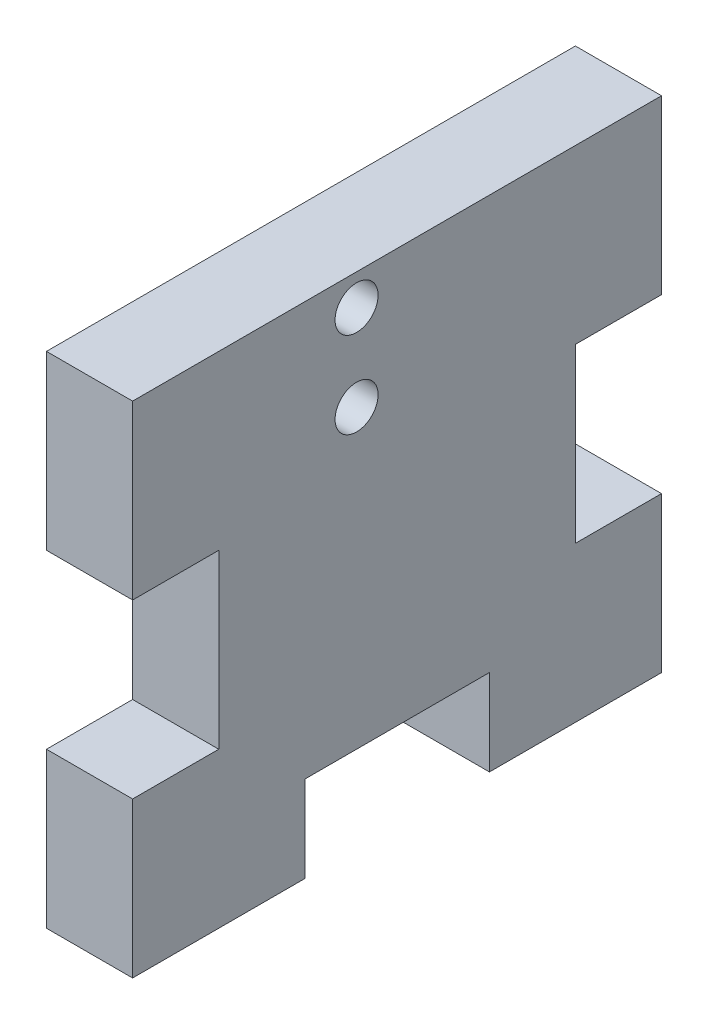
ISO-10303-21;
HEADER;
FILE_DESCRIPTION(('STEP AP214'),'2;1');
FILE_NAME('part.step','',(''),(''),'','','');
FILE_SCHEMA(('AUTOMOTIVE_DESIGN { 1 0 10303 214 1 1 1 1 }'));
ENDSEC;
DATA;
#1=APPLICATION_CONTEXT('core data for automotive mechanical design processes');
#2=APPLICATION_PROTOCOL_DEFINITION('international standard','automotive_design',2000,#1);
#3=PRODUCT_CONTEXT('',#1,'mechanical');
#4=PRODUCT('Part','Part','',(#3));
#5=PRODUCT_RELATED_PRODUCT_CATEGORY('part','',(#4));
#6=PRODUCT_DEFINITION_FORMATION('','',#4);
#7=PRODUCT_DEFINITION_CONTEXT('part definition',#1,'design');
#8=PRODUCT_DEFINITION('design','',#6,#7);
#9=PRODUCT_DEFINITION_SHAPE('','',#8);
#10=(LENGTH_UNIT() NAMED_UNIT(*) SI_UNIT(.MILLI.,.METRE.));
#11=(NAMED_UNIT(*) PLANE_ANGLE_UNIT() SI_UNIT($,.RADIAN.));
#12=(NAMED_UNIT(*) SI_UNIT($,.STERADIAN.) SOLID_ANGLE_UNIT());
#13=UNCERTAINTY_MEASURE_WITH_UNIT(LENGTH_MEASURE(1.E-05),#10,'distance_accuracy_value','');
#14=(GEOMETRIC_REPRESENTATION_CONTEXT(3) GLOBAL_UNCERTAINTY_ASSIGNED_CONTEXT((#13)) GLOBAL_UNIT_ASSIGNED_CONTEXT((#10,
#11,#12)) REPRESENTATION_CONTEXT('',''));
#15=CARTESIAN_POINT('',(0.,0.,0.));
#16=DIRECTION('',(0.,0.,1.));
#17=DIRECTION('',(1.,0.,0.));
#18=AXIS2_PLACEMENT_3D('',#15,#16,#17);
#19=CARTESIAN_POINT('',(72.39,17.78,0.));
#20=DIRECTION('',(0.,-1.,0.));
#21=DIRECTION('',(0.,0.,-1.));
#22=AXIS2_PLACEMENT_3D('',#19,#20,#21);
#23=PLANE('',#22);
#24=DIRECTION('',(0.,0.,-1.));
#25=VECTOR('',#24,1.);
#26=CARTESIAN_POINT('',(78.74,17.78,0.));
#27=LINE('',#26,#25);
#28=CARTESIAN_POINT('',(78.74,17.78,6.33525113809477));
#29=VERTEX_POINT('',#28);
#30=CARTESIAN_POINT('',(78.74,17.78,-0.0147488619052227));
#31=VERTEX_POINT('',#30);
#32=EDGE_CURVE('E261',#29,#31,#27,.T.);
#33=ORIENTED_EDGE('',*,*,#32,.F.);
#34=DIRECTION('',(1.,0.,0.));
#35=VECTOR('',#34,1.);
#36=CARTESIAN_POINT('',(72.39,17.78,6.33525113809477));
#37=LINE('',#36,#35);
#38=CARTESIAN_POINT('',(72.39,17.78,6.33525113809477));
#39=VERTEX_POINT('',#38);
#40=EDGE_CURVE('E11',#39,#29,#37,.T.);
#41=ORIENTED_EDGE('',*,*,#40,.F.);
#42=DIRECTION('',(0.,0.,-1.));
#43=VECTOR('',#42,1.);
#44=CARTESIAN_POINT('',(72.39,17.78,0.));
#45=LINE('',#44,#43);
#46=CARTESIAN_POINT('',(72.39,17.78,-0.0147488619052227));
#47=VERTEX_POINT('',#46);
#48=EDGE_CURVE('E208',#39,#47,#45,.T.);
#49=ORIENTED_EDGE('',*,*,#48,.T.);
#50=DIRECTION('',(1.,0.,0.));
#51=VECTOR('',#50,1.);
#52=CARTESIAN_POINT('',(72.39,17.78,-0.0147488619052227));
#53=LINE('',#52,#51);
#54=EDGE_CURVE('E36',#47,#31,#53,.T.);
#55=ORIENTED_EDGE('',*,*,#54,.T.);
#56=EDGE_LOOP('',(#33,#41,#49,#55));
#57=FACE_BOUND('',#56,.T.);
#58=ADVANCED_FACE('F32',(#57),#23,.T.);
#59=CARTESIAN_POINT('',(72.39,0.,6.33525113809477));
#60=DIRECTION('',(0.,0.,-1.));
#61=DIRECTION('',(-1.,0.,0.));
#62=AXIS2_PLACEMENT_3D('',#59,#60,#61);
#63=PLANE('',#62);
#64=DIRECTION('',(0.,1.,0.));
#65=VECTOR('',#64,1.);
#66=CARTESIAN_POINT('',(78.74,0.,6.33525113809477));
#67=LINE('',#66,#65);
#68=CARTESIAN_POINT('',(78.74,30.48,6.33525113809477));
#69=VERTEX_POINT('',#68);
#70=EDGE_CURVE('E216',#29,#69,#67,.T.);
#71=ORIENTED_EDGE('',*,*,#70,.T.);
#72=DIRECTION('',(1.,0.,0.));
#73=VECTOR('',#72,1.);
#74=CARTESIAN_POINT('',(72.39,30.48,6.33525113809477));
#75=LINE('',#74,#73);
#76=CARTESIAN_POINT('',(72.39,30.48,6.33525113809477));
#77=VERTEX_POINT('',#76);
#78=EDGE_CURVE('E42',#77,#69,#75,.T.);
#79=ORIENTED_EDGE('',*,*,#78,.F.);
#80=DIRECTION('',(0.,1.,0.));
#81=VECTOR('',#80,1.);
#82=CARTESIAN_POINT('',(72.39,0.,6.33525113809477));
#83=LINE('',#82,#81);
#84=EDGE_CURVE('E169',#39,#77,#83,.T.);
#85=ORIENTED_EDGE('',*,*,#84,.F.);
#86=ORIENTED_EDGE('',*,*,#40,.T.);
#87=EDGE_LOOP('',(#71,#79,#85,#86));
#88=FACE_BOUND('',#87,.T.);
#89=ADVANCED_FACE('F302',(#88),#63,.F.);
#90=CARTESIAN_POINT('',(72.39,30.48,0.));
#91=DIRECTION('',(0.,1.,0.));
#92=DIRECTION('',(0.,0.,1.));
#93=AXIS2_PLACEMENT_3D('',#90,#91,#92);
#94=PLANE('',#93);
#95=DIRECTION('',(0.,0.,1.));
#96=VECTOR('',#95,1.);
#97=CARTESIAN_POINT('',(78.74,30.48,0.));
#98=LINE('',#97,#96);
#99=CARTESIAN_POINT('',(78.74,30.48,-32.6554205404025));
#100=VERTEX_POINT('',#99);
#101=EDGE_CURVE('E155',#100,#69,#98,.T.);
#102=ORIENTED_EDGE('',*,*,#101,.F.);
#103=DIRECTION('',(1.,0.,0.));
#104=VECTOR('',#103,1.);
#105=CARTESIAN_POINT('',(72.39,30.48,-32.6554205404025));
#106=LINE('',#105,#104);
#107=CARTESIAN_POINT('',(72.39,30.48,-32.6554205404025));
#108=VERTEX_POINT('',#107);
#109=EDGE_CURVE('E150',#108,#100,#106,.T.);
#110=ORIENTED_EDGE('',*,*,#109,.F.);
#111=DIRECTION('',(0.,0.,1.));
#112=VECTOR('',#111,1.);
#113=CARTESIAN_POINT('',(72.39,30.48,0.));
#114=LINE('',#113,#112);
#115=EDGE_CURVE('E153',#108,#77,#114,.T.);
#116=ORIENTED_EDGE('',*,*,#115,.T.);
#117=ORIENTED_EDGE('',*,*,#78,.T.);
#118=EDGE_LOOP('',(#102,#110,#116,#117));
#119=FACE_BOUND('',#118,.T.);
#120=ADVANCED_FACE('F152',(#119),#94,.T.);
#121=CARTESIAN_POINT('',(72.39,0.,-32.6554205404025));
#122=DIRECTION('',(0.,0.,-1.));
#123=DIRECTION('',(-1.,0.,0.));
#124=AXIS2_PLACEMENT_3D('',#121,#122,#123);
#125=PLANE('',#124);
#126=DIRECTION('',(0.,1.,0.));
#127=VECTOR('',#126,1.);
#128=CARTESIAN_POINT('',(78.74,0.,-32.6554205404025));
#129=LINE('',#128,#127);
#130=CARTESIAN_POINT('',(78.74,17.78,-32.6554205404025));
#131=VERTEX_POINT('',#130);
#132=EDGE_CURVE('E289',#131,#100,#129,.T.);
#133=ORIENTED_EDGE('',*,*,#132,.F.);
#134=DIRECTION('',(1.,0.,0.));
#135=VECTOR('',#134,1.);
#136=CARTESIAN_POINT('',(72.39,17.78,-32.6554205404025));
#137=LINE('',#136,#135);
#138=CARTESIAN_POINT('',(72.39,17.78,-32.6554205404025));
#139=VERTEX_POINT('',#138);
#140=EDGE_CURVE('E160',#139,#131,#137,.T.);
#141=ORIENTED_EDGE('',*,*,#140,.F.);
#142=DIRECTION('',(0.,1.,0.));
#143=VECTOR('',#142,1.);
#144=CARTESIAN_POINT('',(72.39,0.,-32.6554205404025));
#145=LINE('',#144,#143);
#146=EDGE_CURVE('E168',#139,#108,#145,.T.);
#147=ORIENTED_EDGE('',*,*,#146,.T.);
#148=ORIENTED_EDGE('',*,*,#109,.T.);
#149=EDGE_LOOP('',(#133,#141,#147,#148));
#150=FACE_BOUND('',#149,.T.);
#151=ADVANCED_FACE('F171',(#150),#125,.T.);
#152=CARTESIAN_POINT('',(72.39,17.78,0.));
#153=DIRECTION('',(0.,1.,0.));
#154=DIRECTION('',(0.,0.,1.));
#155=AXIS2_PLACEMENT_3D('',#152,#153,#154);
#156=PLANE('',#155);
#157=DIRECTION('',(0.,0.,1.));
#158=VECTOR('',#157,1.);
#159=CARTESIAN_POINT('',(78.74,17.78,0.));
#160=LINE('',#159,#158);
#161=CARTESIAN_POINT('',(78.74,17.78,-26.3201694023077));
#162=VERTEX_POINT('',#161);
#163=EDGE_CURVE('E294',#131,#162,#160,.T.);
#164=ORIENTED_EDGE('',*,*,#163,.T.);
#165=DIRECTION('',(1.,0.,0.));
#166=VECTOR('',#165,1.);
#167=CARTESIAN_POINT('',(72.39,17.78,-26.3201694023077));
#168=LINE('',#167,#166);
#169=CARTESIAN_POINT('',(72.39,17.78,-26.3201694023077));
#170=VERTEX_POINT('',#169);
#171=EDGE_CURVE('E227',#170,#162,#168,.T.);
#172=ORIENTED_EDGE('',*,*,#171,.F.);
#173=DIRECTION('',(0.,0.,1.));
#174=VECTOR('',#173,1.);
#175=CARTESIAN_POINT('',(72.39,17.78,0.));
#176=LINE('',#175,#174);
#177=EDGE_CURVE('E173',#139,#170,#176,.T.);
#178=ORIENTED_EDGE('',*,*,#177,.F.);
#179=ORIENTED_EDGE('',*,*,#140,.T.);
#180=EDGE_LOOP('',(#164,#172,#178,#179));
#181=FACE_BOUND('',#180,.T.);
#182=ADVANCED_FACE('F343',(#181),#156,.F.);
#183=CARTESIAN_POINT('',(72.39,0.,-26.3201694023077));
#184=DIRECTION('',(0.,0.,1.));
#185=DIRECTION('',(0.,-1.,0.));
#186=AXIS2_PLACEMENT_3D('',#183,#184,#185);
#187=PLANE('',#186);
#188=DIRECTION('',(0.,-1.,0.));
#189=VECTOR('',#188,1.);
#190=CARTESIAN_POINT('',(78.74,0.,-26.3201694023077));
#191=LINE('',#190,#189);
#192=CARTESIAN_POINT('',(78.74,5.08,-26.3201694023077));
#193=VERTEX_POINT('',#192);
#194=EDGE_CURVE('E292',#162,#193,#191,.T.);
#195=ORIENTED_EDGE('',*,*,#194,.T.);
#196=DIRECTION('',(1.,0.,0.));
#197=VECTOR('',#196,1.);
#198=CARTESIAN_POINT('',(72.39,5.08,-26.3201694023077));
#199=LINE('',#198,#197);
#200=CARTESIAN_POINT('',(72.39,5.08,-26.3201694023077));
#201=VERTEX_POINT('',#200);
#202=EDGE_CURVE('E230',#201,#193,#199,.T.);
#203=ORIENTED_EDGE('',*,*,#202,.F.);
#204=DIRECTION('',(0.,-1.,0.));
#205=VECTOR('',#204,1.);
#206=CARTESIAN_POINT('',(72.39,0.,-26.3201694023077));
#207=LINE('',#206,#205);
#208=EDGE_CURVE('E176',#170,#201,#207,.T.);
#209=ORIENTED_EDGE('',*,*,#208,.F.);
#210=ORIENTED_EDGE('',*,*,#171,.T.);
#211=EDGE_LOOP('',(#195,#203,#209,#210));
#212=FACE_BOUND('',#211,.T.);
#213=ADVANCED_FACE('F339',(#212),#187,.F.);
#214=CARTESIAN_POINT('',(72.39,5.08,0.));
#215=DIRECTION('',(0.,1.,0.));
#216=DIRECTION('',(0.,0.,1.));
#217=AXIS2_PLACEMENT_3D('',#214,#215,#216);
#218=PLANE('',#217);
#219=DIRECTION('',(0.,0.,1.));
#220=VECTOR('',#219,1.);
#221=CARTESIAN_POINT('',(78.74,5.08,0.));
#222=LINE('',#221,#220);
#223=CARTESIAN_POINT('',(78.74,5.08,-32.6554205404025));
#224=VERTEX_POINT('',#223);
#225=EDGE_CURVE('E288',#224,#193,#222,.T.);
#226=ORIENTED_EDGE('',*,*,#225,.F.);
#227=DIRECTION('',(1.,0.,0.));
#228=VECTOR('',#227,1.);
#229=CARTESIAN_POINT('',(72.39,5.08,-32.6554205404025));
#230=LINE('',#229,#228);
#231=CARTESIAN_POINT('',(72.39,5.08,-32.6554205404025));
#232=VERTEX_POINT('',#231);
#233=EDGE_CURVE('E232',#232,#224,#230,.T.);
#234=ORIENTED_EDGE('',*,*,#233,.F.);
#235=DIRECTION('',(0.,0.,1.));
#236=VECTOR('',#235,1.);
#237=CARTESIAN_POINT('',(72.39,5.08,0.));
#238=LINE('',#237,#236);
#239=EDGE_CURVE('E181',#232,#201,#238,.T.);
#240=ORIENTED_EDGE('',*,*,#239,.T.);
#241=ORIENTED_EDGE('',*,*,#202,.T.);
#242=EDGE_LOOP('',(#226,#234,#240,#241));
#243=FACE_BOUND('',#242,.T.);
#244=ADVANCED_FACE('F336',(#243),#218,.T.);
#245=CARTESIAN_POINT('',(78.74,-6.34999999999999,-32.6554205404025));
#246=VERTEX_POINT('',#245);
#247=EDGE_CURVE('E285',#246,#224,#129,.T.);
#248=ORIENTED_EDGE('',*,*,#247,.F.);
#249=DIRECTION('',(1.,0.,0.));
#250=VECTOR('',#249,1.);
#251=CARTESIAN_POINT('',(72.39,-6.34999999999999,-32.6554205404025));
#252=LINE('',#251,#250);
#253=CARTESIAN_POINT('',(72.39,-6.34999999999999,-32.6554205404025));
#254=VERTEX_POINT('',#253);
#255=EDGE_CURVE('E234',#254,#246,#252,.T.);
#256=ORIENTED_EDGE('',*,*,#255,.F.);
#257=EDGE_CURVE('E175',#254,#232,#145,.T.);
#258=ORIENTED_EDGE('',*,*,#257,.T.);
#259=ORIENTED_EDGE('',*,*,#233,.T.);
#260=EDGE_LOOP('',(#248,#256,#258,#259));
#261=FACE_BOUND('',#260,.T.);
#262=ADVANCED_FACE('F335',(#261),#125,.T.);
#263=CARTESIAN_POINT('',(72.39,-6.35,0.));
#264=DIRECTION('',(0.,-1.,0.));
#265=DIRECTION('',(0.,0.,-1.));
#266=AXIS2_PLACEMENT_3D('',#263,#264,#265);
#267=PLANE('',#266);
#268=DIRECTION('',(0.,0.,-1.));
#269=VECTOR('',#268,1.);
#270=CARTESIAN_POINT('',(78.74,-6.35,0.));
#271=LINE('',#270,#269);
#272=CARTESIAN_POINT('',(78.74,-6.35,-19.9701694023077));
#273=VERTEX_POINT('',#272);
#274=EDGE_CURVE('E282',#273,#246,#271,.T.);
#275=ORIENTED_EDGE('',*,*,#274,.F.);
#276=DIRECTION('',(1.,0.,0.));
#277=VECTOR('',#276,1.);
#278=CARTESIAN_POINT('',(72.39,-6.35,-19.9701694023077));
#279=LINE('',#278,#277);
#280=CARTESIAN_POINT('',(72.39,-6.35,-19.9701694023077));
#281=VERTEX_POINT('',#280);
#282=EDGE_CURVE('E236',#281,#273,#279,.T.);
#283=ORIENTED_EDGE('',*,*,#282,.F.);
#284=DIRECTION('',(0.,0.,-1.));
#285=VECTOR('',#284,1.);
#286=CARTESIAN_POINT('',(72.39,-6.35,0.));
#287=LINE('',#286,#285);
#288=EDGE_CURVE('E182',#281,#254,#287,.T.);
#289=ORIENTED_EDGE('',*,*,#288,.T.);
#290=ORIENTED_EDGE('',*,*,#255,.T.);
#291=EDGE_LOOP('',(#275,#283,#289,#290));
#292=FACE_BOUND('',#291,.T.);
#293=ADVANCED_FACE('F331',(#292),#267,.T.);
#294=CARTESIAN_POINT('',(72.39,0.,-19.9701694023077));
#295=DIRECTION('',(0.,0.,1.));
#296=DIRECTION('',(1.,0.,0.));
#297=AXIS2_PLACEMENT_3D('',#294,#295,#296);
#298=PLANE('',#297);
#299=DIRECTION('',(0.,-1.,0.));
#300=VECTOR('',#299,1.);
#301=CARTESIAN_POINT('',(78.74,0.,-19.9701694023077));
#302=LINE('',#301,#300);
#303=CARTESIAN_POINT('',(78.74,0.,-19.9701694023077));
#304=VERTEX_POINT('',#303);
#305=EDGE_CURVE('E279',#304,#273,#302,.T.);
#306=ORIENTED_EDGE('',*,*,#305,.F.);
#307=DIRECTION('',(1.,0.,0.));
#308=VECTOR('',#307,1.);
#309=CARTESIAN_POINT('',(72.39,0.,-19.9701694023077));
#310=LINE('',#309,#308);
#311=CARTESIAN_POINT('',(72.39,0.,-19.9701694023077));
#312=VERTEX_POINT('',#311);
#313=EDGE_CURVE('E238',#312,#304,#310,.T.);
#314=ORIENTED_EDGE('',*,*,#313,.F.);
#315=DIRECTION('',(0.,-1.,0.));
#316=VECTOR('',#315,1.);
#317=CARTESIAN_POINT('',(72.39,0.,-19.9701694023077));
#318=LINE('',#317,#316);
#319=EDGE_CURVE('E187',#312,#281,#318,.T.);
#320=ORIENTED_EDGE('',*,*,#319,.T.);
#321=ORIENTED_EDGE('',*,*,#282,.T.);
#322=EDGE_LOOP('',(#306,#314,#320,#321));
#323=FACE_BOUND('',#322,.T.);
#324=ADVANCED_FACE('F327',(#323),#298,.T.);
#325=CARTESIAN_POINT('',(72.39,0.,0.));
#326=DIRECTION('',(0.,1.,0.));
#327=DIRECTION('',(0.,0.,1.));
#328=AXIS2_PLACEMENT_3D('',#325,#326,#327);
#329=PLANE('',#328);
#330=DIRECTION('',(0.,0.,1.));
#331=VECTOR('',#330,1.);
#332=CARTESIAN_POINT('',(78.74,0.,0.));
#333=LINE('',#332,#331);
#334=CARTESIAN_POINT('',(78.74,0.,-6.36474886190522));
#335=VERTEX_POINT('',#334);
#336=EDGE_CURVE('E276',#304,#335,#333,.T.);
#337=ORIENTED_EDGE('',*,*,#336,.T.);
#338=DIRECTION('',(1.,0.,0.));
#339=VECTOR('',#338,1.);
#340=CARTESIAN_POINT('',(72.39,0.,-6.36474886190522));
#341=LINE('',#340,#339);
#342=CARTESIAN_POINT('',(72.39,0.,-6.36474886190522));
#343=VERTEX_POINT('',#342);
#344=EDGE_CURVE('E240',#343,#335,#341,.T.);
#345=ORIENTED_EDGE('',*,*,#344,.F.);
#346=DIRECTION('',(0.,0.,1.));
#347=VECTOR('',#346,1.);
#348=CARTESIAN_POINT('',(72.39,0.,0.));
#349=LINE('',#348,#347);
#350=EDGE_CURVE('E191',#312,#343,#349,.T.);
#351=ORIENTED_EDGE('',*,*,#350,.F.);
#352=ORIENTED_EDGE('',*,*,#313,.T.);
#353=EDGE_LOOP('',(#337,#345,#351,#352));
#354=FACE_BOUND('',#353,.T.);
#355=ADVANCED_FACE('F323',(#354),#329,.F.);
#356=CARTESIAN_POINT('',(72.39,0.,-6.36474886190522));
#357=DIRECTION('',(0.,0.,1.));
#358=DIRECTION('',(1.,0.,0.));
#359=AXIS2_PLACEMENT_3D('',#356,#357,#358);
#360=PLANE('',#359);
#361=DIRECTION('',(0.,-1.,0.));
#362=VECTOR('',#361,1.);
#363=CARTESIAN_POINT('',(78.74,0.,-6.36474886190522));
#364=LINE('',#363,#362);
#365=CARTESIAN_POINT('',(78.74,-6.35,-6.36474886190522));
#366=VERTEX_POINT('',#365);
#367=EDGE_CURVE('E273',#335,#366,#364,.T.);
#368=ORIENTED_EDGE('',*,*,#367,.T.);
#369=DIRECTION('',(1.,0.,0.));
#370=VECTOR('',#369,1.);
#371=CARTESIAN_POINT('',(72.39,-6.35,-6.36474886190522));
#372=LINE('',#371,#370);
#373=CARTESIAN_POINT('',(72.39,-6.35,-6.36474886190522));
#374=VERTEX_POINT('',#373);
#375=EDGE_CURVE('E243',#374,#366,#372,.T.);
#376=ORIENTED_EDGE('',*,*,#375,.F.);
#377=DIRECTION('',(0.,-1.,0.));
#378=VECTOR('',#377,1.);
#379=CARTESIAN_POINT('',(72.39,0.,-6.36474886190522));
#380=LINE('',#379,#378);
#381=EDGE_CURVE('E196',#343,#374,#380,.T.);
#382=ORIENTED_EDGE('',*,*,#381,.F.);
#383=ORIENTED_EDGE('',*,*,#344,.T.);
#384=EDGE_LOOP('',(#368,#376,#382,#383));
#385=FACE_BOUND('',#384,.T.);
#386=ADVANCED_FACE('F319',(#385),#360,.F.);
#387=CARTESIAN_POINT('',(72.39,-6.35,0.));
#388=DIRECTION('',(0.,-1.,0.));
#389=DIRECTION('',(0.,0.,-1.));
#390=AXIS2_PLACEMENT_3D('',#387,#388,#389);
#391=PLANE('',#390);
#392=DIRECTION('',(0.,0.,-1.));
#393=VECTOR('',#392,1.);
#394=CARTESIAN_POINT('',(78.74,-6.35,0.));
#395=LINE('',#394,#393);
#396=CARTESIAN_POINT('',(78.74,-6.35,6.33525113809477));
#397=VERTEX_POINT('',#396);
#398=EDGE_CURVE('E270',#397,#366,#395,.T.);
#399=ORIENTED_EDGE('',*,*,#398,.F.);
#400=DIRECTION('',(1.,0.,0.));
#401=VECTOR('',#400,1.);
#402=CARTESIAN_POINT('',(72.39,-6.35,6.33525113809477));
#403=LINE('',#402,#401);
#404=CARTESIAN_POINT('',(72.39,-6.35,6.33525113809477));
#405=VERTEX_POINT('',#404);
#406=EDGE_CURVE('E245',#405,#397,#403,.T.);
#407=ORIENTED_EDGE('',*,*,#406,.F.);
#408=DIRECTION('',(0.,0.,-1.));
#409=VECTOR('',#408,1.);
#410=CARTESIAN_POINT('',(72.39,-6.35,0.));
#411=LINE('',#410,#409);
#412=EDGE_CURVE('E198',#405,#374,#411,.T.);
#413=ORIENTED_EDGE('',*,*,#412,.T.);
#414=ORIENTED_EDGE('',*,*,#375,.T.);
#415=EDGE_LOOP('',(#399,#407,#413,#414));
#416=FACE_BOUND('',#415,.T.);
#417=ADVANCED_FACE('F316',(#416),#391,.T.);
#418=CARTESIAN_POINT('',(78.74,5.08,6.33525113809477));
#419=VERTEX_POINT('',#418);
#420=EDGE_CURVE('E221',#397,#419,#67,.T.);
#421=ORIENTED_EDGE('',*,*,#420,.T.);
#422=DIRECTION('',(1.,0.,0.));
#423=VECTOR('',#422,1.);
#424=CARTESIAN_POINT('',(72.39,5.08,6.33525113809477));
#425=LINE('',#424,#423);
#426=CARTESIAN_POINT('',(72.39,5.08,6.33525113809477));
#427=VERTEX_POINT('',#426);
#428=EDGE_CURVE('E247',#427,#419,#425,.T.);
#429=ORIENTED_EDGE('',*,*,#428,.F.);
#430=EDGE_CURVE('E201',#405,#427,#83,.T.);
#431=ORIENTED_EDGE('',*,*,#430,.F.);
#432=ORIENTED_EDGE('',*,*,#406,.T.);
#433=EDGE_LOOP('',(#421,#429,#431,#432));
#434=FACE_BOUND('',#433,.T.);
#435=ADVANCED_FACE('F307',(#434),#63,.F.);
#436=CARTESIAN_POINT('',(72.39,5.08,0.));
#437=DIRECTION('',(0.,-1.,0.));
#438=DIRECTION('',(0.,0.,-1.));
#439=AXIS2_PLACEMENT_3D('',#436,#437,#438);
#440=PLANE('',#439);
#441=DIRECTION('',(0.,0.,-1.));
#442=VECTOR('',#441,1.);
#443=CARTESIAN_POINT('',(78.74,5.08,0.));
#444=LINE('',#443,#442);
#445=CARTESIAN_POINT('',(78.74,5.08,-0.0147488619052227));
#446=VERTEX_POINT('',#445);
#447=EDGE_CURVE('E267',#419,#446,#444,.T.);
#448=ORIENTED_EDGE('',*,*,#447,.T.);
#449=DIRECTION('',(1.,0.,0.));
#450=VECTOR('',#449,1.);
#451=CARTESIAN_POINT('',(72.39,5.08,-0.0147488619052227));
#452=LINE('',#451,#450);
#453=CARTESIAN_POINT('',(72.39,5.08,-0.0147488619052227));
#454=VERTEX_POINT('',#453);
#455=EDGE_CURVE('E249',#454,#446,#452,.T.);
#456=ORIENTED_EDGE('',*,*,#455,.F.);
#457=DIRECTION('',(0.,0.,-1.));
#458=VECTOR('',#457,1.);
#459=CARTESIAN_POINT('',(72.39,5.08,0.));
#460=LINE('',#459,#458);
#461=EDGE_CURVE('E204',#427,#454,#460,.T.);
#462=ORIENTED_EDGE('',*,*,#461,.F.);
#463=ORIENTED_EDGE('',*,*,#428,.T.);
#464=EDGE_LOOP('',(#448,#456,#462,#463));
#465=FACE_BOUND('',#464,.T.);
#466=ADVANCED_FACE('F312',(#465),#440,.F.);
#467=CARTESIAN_POINT('',(72.39,0.,-0.0147488619052227));
#468=DIRECTION('',(0.,0.,1.));
#469=DIRECTION('',(1.,0.,0.));
#470=AXIS2_PLACEMENT_3D('',#467,#468,#469);
#471=PLANE('',#470);
#472=DIRECTION('',(0.,-1.,0.));
#473=VECTOR('',#472,1.);
#474=CARTESIAN_POINT('',(78.74,0.,-0.0147488619052227));
#475=LINE('',#474,#473);
#476=EDGE_CURVE('E264',#31,#446,#475,.T.);
#477=ORIENTED_EDGE('',*,*,#476,.F.);
#478=ORIENTED_EDGE('',*,*,#54,.F.);
#479=DIRECTION('',(0.,-1.,0.));
#480=VECTOR('',#479,1.);
#481=CARTESIAN_POINT('',(72.39,0.,-0.0147488619052227));
#482=LINE('',#481,#480);
#483=EDGE_CURVE('E206',#47,#454,#482,.T.);
#484=ORIENTED_EDGE('',*,*,#483,.T.);
#485=ORIENTED_EDGE('',*,*,#455,.T.);
#486=EDGE_LOOP('',(#477,#478,#484,#485));
#487=FACE_BOUND('',#486,.T.);
#488=ADVANCED_FACE('F309',(#487),#471,.T.);
#489=CARTESIAN_POINT('',(72.39,28.194,-10.1747488619052));
#490=DIRECTION('',(1.,0.,0.));
#491=DIRECTION('',(0.,0.,-1.));
#492=AXIS2_PLACEMENT_3D('',#489,#490,#491);
#493=CYLINDRICAL_SURFACE('',#492,1.5875);
#494=CARTESIAN_POINT('',(72.39,28.194,-10.1747488619052));
#495=DIRECTION('',(1.,0.,0.));
#496=DIRECTION('',(0.,0.,-1.));
#497=AXIS2_PLACEMENT_3D('',#494,#495,#496);
#498=CIRCLE('',#497,1.5875);
#499=CARTESIAN_POINT('',(72.39,28.194,-11.7622488619052));
#500=VERTEX_POINT('',#499);
#501=EDGE_CURVE('E210',#500,#500,#498,.F.);
#502=ORIENTED_EDGE('',*,*,#501,.T.);
#503=EDGE_LOOP('',(#502));
#504=FACE_BOUND('',#503,.T.);
#505=CARTESIAN_POINT('',(78.74,28.194,-10.1747488619052));
#506=DIRECTION('',(1.,0.,0.));
#507=DIRECTION('',(0.,0.,-1.));
#508=AXIS2_PLACEMENT_3D('',#505,#506,#507);
#509=CIRCLE('',#508,1.5875);
#510=CARTESIAN_POINT('',(78.74,28.194,-11.7622488619052));
#511=VERTEX_POINT('',#510);
#512=EDGE_CURVE('E258',#511,#511,#509,.F.);
#513=ORIENTED_EDGE('',*,*,#512,.F.);
#514=EDGE_LOOP('',(#513));
#515=FACE_BOUND('',#514,.T.);
#516=ADVANCED_FACE('F34',(#504,#515),#493,.F.);
#517=CARTESIAN_POINT('',(72.39,21.844,-10.1747488619052));
#518=DIRECTION('',(1.,0.,0.));
#519=DIRECTION('',(0.,0.,-1.));
#520=AXIS2_PLACEMENT_3D('',#517,#518,#519);
#521=CYLINDRICAL_SURFACE('',#520,1.5875);
#522=CARTESIAN_POINT('',(72.39,21.844,-10.1747488619052));
#523=DIRECTION('',(1.,0.,0.));
#524=DIRECTION('',(0.,0.,-1.));
#525=AXIS2_PLACEMENT_3D('',#522,#523,#524);
#526=CIRCLE('',#525,1.5875);
#527=CARTESIAN_POINT('',(72.39,21.844,-11.7622488619052));
#528=VERTEX_POINT('',#527);
#529=EDGE_CURVE('E252',#528,#528,#526,.F.);
#530=ORIENTED_EDGE('',*,*,#529,.T.);
#531=EDGE_LOOP('',(#530));
#532=FACE_BOUND('',#531,.T.);
#533=CARTESIAN_POINT('',(78.74,21.844,-10.1747488619052));
#534=DIRECTION('',(1.,0.,0.));
#535=DIRECTION('',(0.,0.,-1.));
#536=AXIS2_PLACEMENT_3D('',#533,#534,#535);
#537=CIRCLE('',#536,1.5875);
#538=CARTESIAN_POINT('',(78.74,21.844,-11.7622488619052));
#539=VERTEX_POINT('',#538);
#540=EDGE_CURVE('E212',#539,#539,#537,.F.);
#541=ORIENTED_EDGE('',*,*,#540,.F.);
#542=EDGE_LOOP('',(#541));
#543=FACE_BOUND('',#542,.T.);
#544=ADVANCED_FACE('F351',(#532,#543),#521,.F.);
#545=CARTESIAN_POINT('',(72.39,0.,0.));
#546=DIRECTION('',(1.,0.,0.));
#547=DIRECTION('',(0.,0.,-1.));
#548=AXIS2_PLACEMENT_3D('',#545,#546,#547);
#549=PLANE('',#548);
#550=ORIENTED_EDGE('',*,*,#501,.F.);
#551=EDGE_LOOP('',(#550));
#552=FACE_BOUND('',#551,.T.);
#553=ORIENTED_EDGE('',*,*,#48,.F.);
#554=ORIENTED_EDGE('',*,*,#84,.T.);
#555=ORIENTED_EDGE('',*,*,#115,.F.);
#556=ORIENTED_EDGE('',*,*,#146,.F.);
#557=ORIENTED_EDGE('',*,*,#177,.T.);
#558=ORIENTED_EDGE('',*,*,#208,.T.);
#559=ORIENTED_EDGE('',*,*,#239,.F.);
#560=ORIENTED_EDGE('',*,*,#257,.F.);
#561=ORIENTED_EDGE('',*,*,#288,.F.);
#562=ORIENTED_EDGE('',*,*,#319,.F.);
#563=ORIENTED_EDGE('',*,*,#350,.T.);
#564=ORIENTED_EDGE('',*,*,#381,.T.);
#565=ORIENTED_EDGE('',*,*,#412,.F.);
#566=ORIENTED_EDGE('',*,*,#430,.T.);
#567=ORIENTED_EDGE('',*,*,#461,.T.);
#568=ORIENTED_EDGE('',*,*,#483,.F.);
#569=EDGE_LOOP('',(#553,#554,#555,#556,#557,#558,#559,#560,#561,#562,#563,#564,#565,#566,#567,#568));
#570=FACE_BOUND('',#569,.T.);
#571=ORIENTED_EDGE('',*,*,#529,.F.);
#572=EDGE_LOOP('',(#571));
#573=FACE_BOUND('',#572,.T.);
#574=ADVANCED_FACE('F165',(#552,#570,#573),#549,.F.);
#575=CARTESIAN_POINT('',(78.74,0.,0.));
#576=DIRECTION('',(1.,0.,0.));
#577=DIRECTION('',(0.,0.,-1.));
#578=AXIS2_PLACEMENT_3D('',#575,#576,#577);
#579=PLANE('',#578);
#580=ORIENTED_EDGE('',*,*,#512,.T.);
#581=EDGE_LOOP('',(#580));
#582=FACE_BOUND('',#581,.T.);
#583=ORIENTED_EDGE('',*,*,#32,.T.);
#584=ORIENTED_EDGE('',*,*,#476,.T.);
#585=ORIENTED_EDGE('',*,*,#447,.F.);
#586=ORIENTED_EDGE('',*,*,#420,.F.);
#587=ORIENTED_EDGE('',*,*,#398,.T.);
#588=ORIENTED_EDGE('',*,*,#367,.F.);
#589=ORIENTED_EDGE('',*,*,#336,.F.);
#590=ORIENTED_EDGE('',*,*,#305,.T.);
#591=ORIENTED_EDGE('',*,*,#274,.T.);
#592=ORIENTED_EDGE('',*,*,#247,.T.);
#593=ORIENTED_EDGE('',*,*,#225,.T.);
#594=ORIENTED_EDGE('',*,*,#194,.F.);
#595=ORIENTED_EDGE('',*,*,#163,.F.);
#596=ORIENTED_EDGE('',*,*,#132,.T.);
#597=ORIENTED_EDGE('',*,*,#101,.T.);
#598=ORIENTED_EDGE('',*,*,#70,.F.);
#599=EDGE_LOOP('',(#583,#584,#585,#586,#587,#588,#589,#590,#591,#592,#593,#594,#595,#596,#597,#598));
#600=FACE_BOUND('',#599,.T.);
#601=ORIENTED_EDGE('',*,*,#540,.T.);
#602=EDGE_LOOP('',(#601));
#603=FACE_BOUND('',#602,.T.);
#604=ADVANCED_FACE('F300',(#582,#600,#603),#579,.T.);
#605=CLOSED_SHELL('',(#58,#89,#120,#151,#182,#213,#244,#262,#293,#324,#355,#386,#417,#435,#466,
#488,#516,#544,#574,#604));
#606=MANIFOLD_SOLID_BREP('B2',#605);
#607=ADVANCED_BREP_SHAPE_REPRESENTATION('',(#18,#606),#14);
#608=SHAPE_DEFINITION_REPRESENTATION(#9,#607);
ENDSEC;
END-ISO-10303-21;
